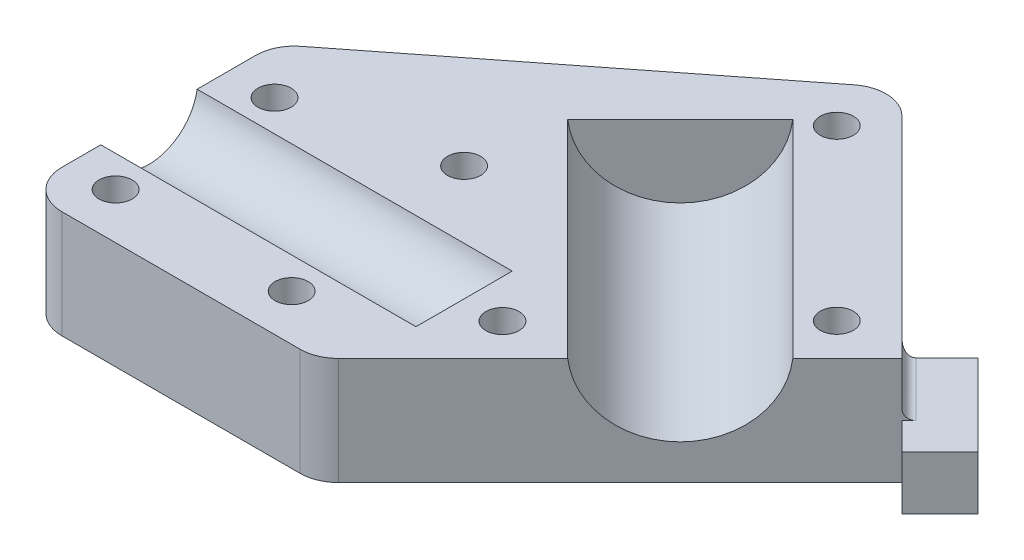
ISO-10303-21;
HEADER;
FILE_DESCRIPTION(('STEP AP214'),'2;1');
FILE_NAME('part.step','',(''),(''),'','','');
FILE_SCHEMA(('AUTOMOTIVE_DESIGN { 1 0 10303 214 1 1 1 1 }'));
ENDSEC;
DATA;
#1=APPLICATION_CONTEXT('core data for automotive mechanical design processes');
#2=APPLICATION_PROTOCOL_DEFINITION('international standard','automotive_design',2000,#1);
#3=PRODUCT_CONTEXT('',#1,'mechanical');
#4=PRODUCT('Part','Part','',(#3));
#5=PRODUCT_RELATED_PRODUCT_CATEGORY('part','',(#4));
#6=PRODUCT_DEFINITION_FORMATION('','',#4);
#7=PRODUCT_DEFINITION_CONTEXT('part definition',#1,'design');
#8=PRODUCT_DEFINITION('design','',#6,#7);
#9=PRODUCT_DEFINITION_SHAPE('','',#8);
#10=(LENGTH_UNIT() NAMED_UNIT(*) SI_UNIT(.MILLI.,.METRE.));
#11=(NAMED_UNIT(*) PLANE_ANGLE_UNIT() SI_UNIT($,.RADIAN.));
#12=(NAMED_UNIT(*) SI_UNIT($,.STERADIAN.) SOLID_ANGLE_UNIT());
#13=UNCERTAINTY_MEASURE_WITH_UNIT(LENGTH_MEASURE(1.E-05),#10,'distance_accuracy_value','');
#14=(GEOMETRIC_REPRESENTATION_CONTEXT(3) GLOBAL_UNCERTAINTY_ASSIGNED_CONTEXT((#13)) GLOBAL_UNIT_ASSIGNED_CONTEXT((#10,
#11,#12)) REPRESENTATION_CONTEXT('',''));
#15=CARTESIAN_POINT('',(0.,0.,0.));
#16=DIRECTION('',(0.,0.,1.));
#17=DIRECTION('',(1.,0.,0.));
#18=AXIS2_PLACEMENT_3D('',#15,#16,#17);
#19=CARTESIAN_POINT('',(-41.0289321881345,-1.,-16.3499999999999));
#20=DIRECTION('',(-0.617406762156341,0.,-0.78664406820596));
#21=DIRECTION('',(-0.78664406820596,0.,0.617406762156341));
#22=AXIS2_PLACEMENT_3D('',#19,#20,#21);
#23=PLANE('',#22);
#24=DIRECTION('',(0.78664406820596,0.,-0.617406762156341));
#25=VECTOR('',#24,1.);
#26=CARTESIAN_POINT('',(-41.0289321881345,-15.,-16.3499999999999));
#27=LINE('',#26,#25);
#28=CARTESIAN_POINT('',(-39.1159659989162,-15.,-17.8514138016617));
#29=VERTEX_POINT('',#28);
#30=CARTESIAN_POINT('',(1.25585463277242,-15.,-49.5377075983135));
#31=VERTEX_POINT('',#30);
#32=EDGE_CURVE('E239',#29,#31,#27,.T.);
#33=ORIENTED_EDGE('',*,*,#32,.F.);
#34=DIRECTION('',(0.,-1.,0.));
#35=VECTOR('',#34,1.);
#36=CARTESIAN_POINT('',(-39.1159659989162,-1.,-17.8514138016617));
#37=LINE('',#36,#35);
#38=CARTESIAN_POINT('',(-39.1159659989162,-1.,-17.8514138016617));
#39=VERTEX_POINT('',#38);
#40=EDGE_CURVE('E301',#29,#39,#37,.F.);
#41=ORIENTED_EDGE('',*,*,#40,.T.);
#42=DIRECTION('',(0.78664406820596,0.,-0.617406762156341));
#43=VECTOR('',#42,1.);
#44=CARTESIAN_POINT('',(-41.0289321881345,-1.,-16.3499999999999));
#45=LINE('',#44,#43);
#46=CARTESIAN_POINT('',(1.25585463277242,-1.,-49.5377075983135));
#47=VERTEX_POINT('',#46);
#48=EDGE_CURVE('E240',#39,#47,#45,.T.);
#49=ORIENTED_EDGE('',*,*,#48,.T.);
#50=DIRECTION('',(0.,-1.,0.));
#51=VECTOR('',#50,1.);
#52=CARTESIAN_POINT('',(1.25585463277243,-1.,-49.5377075983135));
#53=LINE('',#52,#51);
#54=EDGE_CURVE('E298',#47,#31,#53,.T.);
#55=ORIENTED_EDGE('',*,*,#54,.T.);
#56=EDGE_LOOP('',(#33,#41,#49,#55));
#57=FACE_BOUND('',#56,.T.);
#58=ADVANCED_FACE('F36',(#57),#23,.T.);
#59=CARTESIAN_POINT('',(-41.0289321881345,-1.,16.35));
#60=DIRECTION('',(-1.,0.,0.));
#61=DIRECTION('',(0.,0.,1.));
#62=AXIS2_PLACEMENT_3D('',#59,#60,#61);
#63=PLANE('',#62);
#64=DIRECTION('',(0.,0.,-1.));
#65=VECTOR('',#64,1.);
#66=CARTESIAN_POINT('',(-41.0289321881345,-15.,16.35));
#67=LINE('',#66,#65);
#68=CARTESIAN_POINT('',(-41.0289321881345,-15.,11.35));
#69=VERTEX_POINT('',#68);
#70=CARTESIAN_POINT('',(-41.0289321881345,-15.,-13.9181934606319));
#71=VERTEX_POINT('',#70);
#72=EDGE_CURVE('E244',#69,#71,#67,.T.);
#73=ORIENTED_EDGE('',*,*,#72,.F.);
#74=DIRECTION('',(0.,-1.,0.));
#75=VECTOR('',#74,1.);
#76=CARTESIAN_POINT('',(-41.0289321881345,-1.,11.35));
#77=LINE('',#76,#75);
#78=CARTESIAN_POINT('',(-41.0289321881345,-1.,11.35));
#79=VERTEX_POINT('',#78);
#80=EDGE_CURVE('E285',#69,#79,#77,.F.);
#81=ORIENTED_EDGE('',*,*,#80,.T.);
#82=DIRECTION('',(0.,0.,-1.));
#83=VECTOR('',#82,1.);
#84=CARTESIAN_POINT('',(-41.0289321881345,-1.,16.35));
#85=LINE('',#84,#83);
#86=CARTESIAN_POINT('',(-41.0289321881345,-0.999999999999999,6.27076550350907));
#87=VERTEX_POINT('',#86);
#88=EDGE_CURVE('E253',#79,#87,#85,.T.);
#89=ORIENTED_EDGE('',*,*,#88,.T.);
#90=CARTESIAN_POINT('',(-41.0289321881345,0.,0.));
#91=DIRECTION('',(-1.,0.,0.));
#92=DIRECTION('',(0.,0.,1.));
#93=AXIS2_PLACEMENT_3D('',#90,#91,#92);
#94=CIRCLE('',#93,6.34999999999996);
#95=CARTESIAN_POINT('',(-41.0289321881345,-1.,-6.27076550350908));
#96=VERTEX_POINT('',#95);
#97=EDGE_CURVE('E190',#96,#87,#94,.T.);
#98=ORIENTED_EDGE('',*,*,#97,.F.);
#99=CARTESIAN_POINT('',(-41.0289321881345,-1.,-13.9181934606319));
#100=VERTEX_POINT('',#99);
#101=EDGE_CURVE('E252',#96,#100,#85,.T.);
#102=ORIENTED_EDGE('',*,*,#101,.T.);
#103=DIRECTION('',(0.,-1.,0.));
#104=VECTOR('',#103,1.);
#105=CARTESIAN_POINT('',(-41.0289321881345,-1.,-13.9181934606319));
#106=LINE('',#105,#104);
#107=EDGE_CURVE('E282',#100,#71,#106,.T.);
#108=ORIENTED_EDGE('',*,*,#107,.T.);
#109=EDGE_LOOP('',(#73,#81,#89,#98,#102,#108));
#110=FACE_BOUND('',#109,.T.);
#111=ADVANCED_FACE('F353',(#110),#63,.T.);
#112=CARTESIAN_POINT('',(-2.92893218813456,-1.,16.35));
#113=DIRECTION('',(0.,0.,1.));
#114=DIRECTION('',(1.,0.,0.));
#115=AXIS2_PLACEMENT_3D('',#112,#113,#114);
#116=PLANE('',#115);
#117=DIRECTION('',(-1.,0.,0.));
#118=VECTOR('',#117,1.);
#119=CARTESIAN_POINT('',(-2.92893218813456,-1.,16.35));
#120=LINE('',#119,#118);
#121=CARTESIAN_POINT('',(-5.00000000000003,-1.,16.35));
#122=VERTEX_POINT('',#121);
#123=CARTESIAN_POINT('',(-36.0289321881345,-1.,16.35));
#124=VERTEX_POINT('',#123);
#125=EDGE_CURVE('E249',#122,#124,#120,.T.);
#126=ORIENTED_EDGE('',*,*,#125,.T.);
#127=DIRECTION('',(0.,-1.,0.));
#128=VECTOR('',#127,1.);
#129=CARTESIAN_POINT('',(-36.0289321881345,-1.,16.35));
#130=LINE('',#129,#128);
#131=CARTESIAN_POINT('',(-36.0289321881345,-15.,16.35));
#132=VERTEX_POINT('',#131);
#133=EDGE_CURVE('E271',#124,#132,#130,.T.);
#134=ORIENTED_EDGE('',*,*,#133,.T.);
#135=DIRECTION('',(-1.,0.,0.));
#136=VECTOR('',#135,1.);
#137=CARTESIAN_POINT('',(-2.92893218813456,-15.,16.35));
#138=LINE('',#137,#136);
#139=CARTESIAN_POINT('',(-5.00000000000003,-15.,16.35));
#140=VERTEX_POINT('',#139);
#141=EDGE_CURVE('E263',#140,#132,#138,.T.);
#142=ORIENTED_EDGE('',*,*,#141,.F.);
#143=DIRECTION('',(0.,-1.,0.));
#144=VECTOR('',#143,1.);
#145=CARTESIAN_POINT('',(-5.00000000000003,-1.,16.35));
#146=LINE('',#145,#144);
#147=EDGE_CURVE('E269',#140,#122,#146,.F.);
#148=ORIENTED_EDGE('',*,*,#147,.T.);
#149=EDGE_LOOP('',(#126,#134,#142,#148));
#150=FACE_BOUND('',#149,.T.);
#151=ADVANCED_FACE('F362',(#150),#116,.T.);
#152=CARTESIAN_POINT('',(35.2197556622844,-1.,-21.7986878504189));
#153=DIRECTION('',(0.707106781186547,0.,0.707106781186548));
#154=DIRECTION('',(0.707106781186548,0.,-0.707106781186547));
#155=AXIS2_PLACEMENT_3D('',#152,#153,#154);
#156=PLANE('',#155);
#157=DIRECTION('',(-0.707106781186548,0.,0.707106781186547));
#158=VECTOR('',#157,1.);
#159=CARTESIAN_POINT('',(35.2197556622844,-1.,-21.7986878504189));
#160=LINE('',#159,#158);
#161=CARTESIAN_POINT('',(13.4550962518592,-1.,-0.0340284399936866));
#162=VERTEX_POINT('',#161);
#163=CARTESIAN_POINT('',(-1.46446609406729,-1.,14.8855339059327));
#164=VERTEX_POINT('',#163);
#165=EDGE_CURVE('E189',#162,#164,#160,.T.);
#166=ORIENTED_EDGE('',*,*,#165,.T.);
#167=DIRECTION('',(0.,-1.,0.));
#168=VECTOR('',#167,1.);
#169=CARTESIAN_POINT('',(-1.46446609406729,-1.,14.8855339059327));
#170=LINE('',#169,#168);
#171=CARTESIAN_POINT('',(-1.46446609406729,-15.,14.8855339059327));
#172=VERTEX_POINT('',#171);
#173=EDGE_CURVE('E295',#164,#172,#170,.T.);
#174=ORIENTED_EDGE('',*,*,#173,.T.);
#175=DIRECTION('',(-0.707106781186548,0.,0.707106781186547));
#176=VECTOR('',#175,1.);
#177=CARTESIAN_POINT('',(35.2197556622844,-15.,-21.7986878504189));
#178=LINE('',#177,#176);
#179=CARTESIAN_POINT('',(35.2197556622844,-15.,-21.7986878504189));
#180=VERTEX_POINT('',#179);
#181=EDGE_CURVE('E260',#180,#172,#178,.T.);
#182=ORIENTED_EDGE('',*,*,#181,.F.);
#183=DIRECTION('',(0.,-1.,0.));
#184=VECTOR('',#183,1.);
#185=CARTESIAN_POINT('',(35.2197556622844,-1.,-21.7986878504189));
#186=LINE('',#185,#184);
#187=CARTESIAN_POINT('',(35.2197556622844,-8.,-21.7986878504189));
#188=VERTEX_POINT('',#187);
#189=EDGE_CURVE('E232',#188,#180,#186,.T.);
#190=ORIENTED_EDGE('',*,*,#189,.F.);
#191=DIRECTION('',(-0.707106781186548,0.,0.707106781186547));
#192=VECTOR('',#191,1.);
#193=CARTESIAN_POINT('',(6.71053390593273,-8.,6.71053390593273));
#194=LINE('',#193,#192);
#195=CARTESIAN_POINT('',(36.1177812743913,-8.,-22.6967134625258));
#196=VERTEX_POINT('',#195);
#197=EDGE_CURVE('E306',#196,#188,#194,.T.);
#198=ORIENTED_EDGE('',*,*,#197,.F.);
#199=CARTESIAN_POINT('',(36.1177812743913,-6.73,-22.6967134625258));
#200=DIRECTION('',(0.707106781186547,0.,0.707106781186548));
#201=DIRECTION('',(0.707106781186548,0.,-0.707106781186547));
#202=AXIS2_PLACEMENT_3D('',#199,#200,#201);
#203=CIRCLE('',#202,1.27);
#204=CARTESIAN_POINT('',(35.2197556622844,-6.73,-21.7986878504189));
#205=VERTEX_POINT('',#204);
#206=EDGE_CURVE('E311',#196,#205,#203,.F.);
#207=ORIENTED_EDGE('',*,*,#206,.T.);
#208=DIRECTION('',(0.,-1.,0.));
#209=VECTOR('',#208,1.);
#210=CARTESIAN_POINT('',(35.2197556622844,-1.,-21.7986878504189));
#211=LINE('',#210,#209);
#212=CARTESIAN_POINT('',(35.2197556622844,-1.,-21.7986878504189));
#213=VERTEX_POINT('',#212);
#214=EDGE_CURVE('E255',#213,#205,#211,.T.);
#215=ORIENTED_EDGE('',*,*,#214,.F.);
#216=CARTESIAN_POINT('',(28.1146594104261,-1.00000000000003,-14.6935915985606));
#217=VERTEX_POINT('',#216);
#218=EDGE_CURVE('E246',#213,#217,#160,.T.);
#219=ORIENTED_EDGE('',*,*,#218,.T.);
#220=CARTESIAN_POINT('',(20.7848778311425,0.,-7.36381001927702));
#221=DIRECTION('',(0.707106781186547,0.,0.707106781186548));
#222=DIRECTION('',(0.707106781186548,0.,-0.707106781186547));
#223=AXIS2_PLACEMENT_3D('',#220,#221,#222);
#224=CIRCLE('',#223,10.4140000000003);
#225=EDGE_CURVE('E180',#162,#217,#224,.T.);
#226=ORIENTED_EDGE('',*,*,#225,.F.);
#227=EDGE_LOOP('',(#166,#174,#182,#190,#198,#207,#215,#219,#226));
#228=FACE_BOUND('',#227,.T.);
#229=ADVANCED_FACE('F371',(#228),#156,.T.);
#230=CARTESIAN_POINT('',(4.74345339314427,-1.,-52.2749901195591));
#231=DIRECTION('',(0.707106781186548,0.,-0.707106781186547));
#232=DIRECTION('',(-0.707106781186547,0.,-0.707106781186548));
#233=AXIS2_PLACEMENT_3D('',#230,#231,#232);
#234=PLANE('',#233);
#235=DIRECTION('',(-0.707106781186547,0.,-0.707106781186548));
#236=VECTOR('',#235,1.);
#237=CARTESIAN_POINT('',(4.74345339314427,-6.73,-52.2749901195591));
#238=LINE('',#237,#236);
#239=CARTESIAN_POINT('',(27.250662238312,-6.73,-29.7677812743913));
#240=VERTEX_POINT('',#239);
#241=EDGE_CURVE('E58',#205,#240,#238,.T.);
#242=ORIENTED_EDGE('',*,*,#241,.T.);
#243=DIRECTION('',(0.,-1.,0.));
#244=VECTOR('',#243,1.);
#245=CARTESIAN_POINT('',(27.250662238312,-15.,-29.7677812743913));
#246=LINE('',#245,#244);
#247=CARTESIAN_POINT('',(27.250662238312,-15.,-29.7677812743913));
#248=VERTEX_POINT('',#247);
#249=EDGE_CURVE('E313',#240,#248,#246,.T.);
#250=ORIENTED_EDGE('',*,*,#249,.T.);
#251=DIRECTION('',(0.707106781186547,0.,0.707106781186548));
#252=VECTOR('',#251,1.);
#253=CARTESIAN_POINT('',(4.74345339314427,-15.,-52.2749901195591));
#254=LINE('',#253,#252);
#255=CARTESIAN_POINT('',(7.87842234948687,-15.,-49.1400211632165));
#256=VERTEX_POINT('',#255);
#257=EDGE_CURVE('E258',#256,#248,#254,.T.);
#258=ORIENTED_EDGE('',*,*,#257,.F.);
#259=DIRECTION('',(0.,-1.,0.));
#260=VECTOR('',#259,1.);
#261=CARTESIAN_POINT('',(7.87842234948687,-1.,-49.1400211632165));
#262=LINE('',#261,#260);
#263=CARTESIAN_POINT('',(7.87842234948687,-1.,-49.1400211632165));
#264=VERTEX_POINT('',#263);
#265=EDGE_CURVE('E303',#256,#264,#262,.F.);
#266=ORIENTED_EDGE('',*,*,#265,.T.);
#267=DIRECTION('',(0.707106781186547,0.,0.707106781186548));
#268=VECTOR('',#267,1.);
#269=CARTESIAN_POINT('',(4.74345339314427,-1.,-52.2749901195591));
#270=LINE('',#269,#268);
#271=EDGE_CURVE('E243',#264,#213,#270,.T.);
#272=ORIENTED_EDGE('',*,*,#271,.T.);
#273=ORIENTED_EDGE('',*,*,#214,.T.);
#274=EDGE_LOOP('',(#242,#250,#258,#266,#272,#273));
#275=FACE_BOUND('',#274,.T.);
#276=ADVANCED_FACE('F333',(#275),#234,.T.);
#277=CARTESIAN_POINT('',(0.,-1.,0.));
#278=DIRECTION('',(0.,-1.,0.));
#279=DIRECTION('',(0.,0.,-1.));
#280=AXIS2_PLACEMENT_3D('',#277,#278,#279);
#281=PLANE('',#280);
#282=CARTESIAN_POINT('',(-35.0289321881345,-1.,10.35));
#283=DIRECTION('',(0.,-1.,0.));
#284=DIRECTION('',(0.,0.,-1.));
#285=AXIS2_PLACEMENT_3D('',#282,#283,#284);
#286=CIRCLE('',#285,2.15899999999999);
#287=CARTESIAN_POINT('',(-35.0289321881345,-1.,8.19100000000001));
#288=VERTEX_POINT('',#287);
#289=EDGE_CURVE('E681',#288,#288,#286,.T.);
#290=ORIENTED_EDGE('',*,*,#289,.T.);
#291=EDGE_LOOP('',(#290));
#292=FACE_BOUND('',#291,.T.);
#293=CARTESIAN_POINT('',(5.,-1.,0.));
#294=DIRECTION('',(0.,-1.,0.));
#295=DIRECTION('',(0.,0.,-1.));
#296=AXIS2_PLACEMENT_3D('',#293,#294,#295);
#297=CIRCLE('',#296,2.15899999999999);
#298=CARTESIAN_POINT('',(5.,-1.,-2.15899999999999));
#299=VERTEX_POINT('',#298);
#300=EDGE_CURVE('E675',#299,#299,#297,.T.);
#301=ORIENTED_EDGE('',*,*,#300,.T.);
#302=EDGE_LOOP('',(#301));
#303=FACE_BOUND('',#302,.T.);
#304=CARTESIAN_POINT('',(-15.,-1.,-15.));
#305=DIRECTION('',(0.,-1.,0.));
#306=DIRECTION('',(0.,0.,-1.));
#307=AXIS2_PLACEMENT_3D('',#304,#305,#306);
#308=CIRCLE('',#307,2.15899999999999);
#309=CARTESIAN_POINT('',(-15.,-1.,-17.159));
#310=VERTEX_POINT('',#309);
#311=EDGE_CURVE('E669',#310,#310,#308,.T.);
#312=ORIENTED_EDGE('',*,*,#311,.T.);
#313=EDGE_LOOP('',(#312));
#314=FACE_BOUND('',#313,.T.);
#315=CARTESIAN_POINT('',(-12.1030431086579,-1.,10.35));
#316=DIRECTION('',(0.,-1.,0.));
#317=DIRECTION('',(0.,0.,-1.));
#318=AXIS2_PLACEMENT_3D('',#315,#316,#317);
#319=CIRCLE('',#318,2.15899999999999);
#320=CARTESIAN_POINT('',(-12.1030431086579,-1.,8.19100000000001));
#321=VERTEX_POINT('',#320);
#322=EDGE_CURVE('E663',#321,#321,#319,.T.);
#323=ORIENTED_EDGE('',*,*,#322,.T.);
#324=EDGE_LOOP('',(#323));
#325=FACE_BOUND('',#324,.T.);
#326=CARTESIAN_POINT('',(-35.0289321881345,-1.,-10.35));
#327=DIRECTION('',(0.,-1.,0.));
#328=DIRECTION('',(0.,0.,-1.));
#329=AXIS2_PLACEMENT_3D('',#326,#327,#328);
#330=CIRCLE('',#329,2.15899999999999);
#331=CARTESIAN_POINT('',(-35.0289321881345,-1.,-12.509));
#332=VERTEX_POINT('',#331);
#333=EDGE_CURVE('E657',#332,#332,#330,.T.);
#334=ORIENTED_EDGE('',*,*,#333,.T.);
#335=EDGE_LOOP('',(#334));
#336=FACE_BOUND('',#335,.T.);
#337=CARTESIAN_POINT('',(4.74345339314418,-1.,-43.7897087453206));
#338=DIRECTION('',(0.,-1.,0.));
#339=DIRECTION('',(0.,0.,-1.));
#340=AXIS2_PLACEMENT_3D('',#337,#338,#339);
#341=CIRCLE('',#340,2.15899999999999);
#342=CARTESIAN_POINT('',(4.74345339314418,-1.,-45.9487087453206));
#343=VERTEX_POINT('',#342);
#344=EDGE_CURVE('E648',#343,#343,#341,.T.);
#345=ORIENTED_EDGE('',*,*,#344,.T.);
#346=EDGE_LOOP('',(#345));
#347=FACE_BOUND('',#346,.T.);
#348=CARTESIAN_POINT('',(26.7344742880458,-1.,-21.7986878504189));
#349=DIRECTION('',(0.,-1.,0.));
#350=DIRECTION('',(0.,0.,-1.));
#351=AXIS2_PLACEMENT_3D('',#348,#349,#350);
#352=CIRCLE('',#351,2.15899999999998);
#353=CARTESIAN_POINT('',(26.7344742880458,-1.,-23.9576878504189));
#354=VERTEX_POINT('',#353);
#355=EDGE_CURVE('E643',#354,#354,#352,.T.);
#356=ORIENTED_EDGE('',*,*,#355,.T.);
#357=EDGE_LOOP('',(#356));
#358=FACE_BOUND('',#357,.T.);
#359=ORIENTED_EDGE('',*,*,#88,.F.);
#360=CARTESIAN_POINT('',(-36.0289321881345,-1.,11.35));
#361=DIRECTION('',(0.,-1.,0.));
#362=DIRECTION('',(0.,0.,-1.));
#363=AXIS2_PLACEMENT_3D('',#360,#361,#362);
#364=CIRCLE('',#363,5.);
#365=EDGE_CURVE('E293',#79,#124,#364,.F.);
#366=ORIENTED_EDGE('',*,*,#365,.T.);
#367=ORIENTED_EDGE('',*,*,#125,.F.);
#368=CARTESIAN_POINT('',(-5.00000000000002,-1.,11.35));
#369=DIRECTION('',(0.,-1.,0.));
#370=DIRECTION('',(0.,0.,-1.));
#371=AXIS2_PLACEMENT_3D('',#368,#369,#370);
#372=CIRCLE('',#371,5.);
#373=EDGE_CURVE('E291',#122,#164,#372,.F.);
#374=ORIENTED_EDGE('',*,*,#373,.T.);
#375=ORIENTED_EDGE('',*,*,#165,.F.);
#376=DIRECTION('',(0.707106781186547,0.,0.707106781186548));
#377=VECTOR('',#376,1.);
#378=CARTESIAN_POINT('',(-13.4856721113483,-1.,-26.9747968032011));
#379=LINE('',#378,#377);
#380=CARTESIAN_POINT('',(-13.4856721113483,-1.,-26.9747968032011));
#381=VERTEX_POINT('',#380);
#382=EDGE_CURVE('E173',#381,#162,#379,.T.);
#383=ORIENTED_EDGE('',*,*,#382,.F.);
#384=DIRECTION('',(-0.707106781186548,0.,0.707106781186547));
#385=VECTOR('',#384,1.);
#386=CARTESIAN_POINT('',(1.17389104721863,-1.00000000000003,-41.634359961768));
#387=LINE('',#386,#385);
#388=CARTESIAN_POINT('',(1.17389104721863,-1.,-41.634359961768));
#389=VERTEX_POINT('',#388);
#390=EDGE_CURVE('E179',#389,#381,#387,.T.);
#391=ORIENTED_EDGE('',*,*,#390,.F.);
#392=DIRECTION('',(0.707106781186547,0.,0.707106781186548));
#393=VECTOR('',#392,1.);
#394=CARTESIAN_POINT('',(1.17389104721863,-1.00000000000003,-41.634359961768));
#395=LINE('',#394,#393);
#396=EDGE_CURVE('E176',#389,#217,#395,.T.);
#397=ORIENTED_EDGE('',*,*,#396,.T.);
#398=ORIENTED_EDGE('',*,*,#218,.F.);
#399=ORIENTED_EDGE('',*,*,#271,.F.);
#400=CARTESIAN_POINT('',(4.34288844355413,-1.,-45.6044872572837));
#401=DIRECTION('',(0.,-1.,0.));
#402=DIRECTION('',(0.,0.,-1.));
#403=AXIS2_PLACEMENT_3D('',#400,#401,#402);
#404=CIRCLE('',#403,5.);
#405=EDGE_CURVE('E287',#264,#47,#404,.F.);
#406=ORIENTED_EDGE('',*,*,#405,.T.);
#407=ORIENTED_EDGE('',*,*,#48,.F.);
#408=CARTESIAN_POINT('',(-36.0289321881345,-1.,-13.9181934606319));
#409=DIRECTION('',(0.,-1.,0.));
#410=DIRECTION('',(0.,0.,-1.));
#411=AXIS2_PLACEMENT_3D('',#408,#409,#410);
#412=CIRCLE('',#411,5.);
#413=EDGE_CURVE('E289',#39,#100,#412,.F.);
#414=ORIENTED_EDGE('',*,*,#413,.T.);
#415=ORIENTED_EDGE('',*,*,#101,.F.);
#416=DIRECTION('',(-1.,0.,0.));
#417=VECTOR('',#416,1.);
#418=CARTESIAN_POINT('',(0.,-1.,-6.27076550350908));
#419=LINE('',#418,#417);
#420=CARTESIAN_POINT('',(0.,-1.,-6.27076550350908));
#421=VERTEX_POINT('',#420);
#422=EDGE_CURVE('E203',#421,#96,#419,.T.);
#423=ORIENTED_EDGE('',*,*,#422,.F.);
#424=DIRECTION('',(0.,0.,-1.));
#425=VECTOR('',#424,1.);
#426=CARTESIAN_POINT('',(0.,-0.999999999999999,6.27076550350907));
#427=LINE('',#426,#425);
#428=CARTESIAN_POINT('',(0.,-1.,6.27076550350907));
#429=VERTEX_POINT('',#428);
#430=EDGE_CURVE('E199',#429,#421,#427,.T.);
#431=ORIENTED_EDGE('',*,*,#430,.F.);
#432=DIRECTION('',(-1.,0.,0.));
#433=VECTOR('',#432,1.);
#434=CARTESIAN_POINT('',(0.,-0.999999999999999,6.27076550350907));
#435=LINE('',#434,#433);
#436=EDGE_CURVE('E201',#429,#87,#435,.T.);
#437=ORIENTED_EDGE('',*,*,#436,.T.);
#438=EDGE_LOOP('',(#359,#366,#367,#374,#375,#383,#391,#397,#398,#399,#406,#407,#414,#415,#423,
#431,#437));
#439=FACE_BOUND('',#438,.T.);
#440=ADVANCED_FACE('F187',(#292,#303,#314,#325,#336,#347,#358,#439),#281,.F.);
#441=CARTESIAN_POINT('',(0.,-15.,0.));
#442=DIRECTION('',(0.,-1.,0.));
#443=DIRECTION('',(0.,0.,-1.));
#444=AXIS2_PLACEMENT_3D('',#441,#442,#443);
#445=PLANE('',#444);
#446=CARTESIAN_POINT('',(-35.0289321881345,-15.,10.35));
#447=DIRECTION('',(0.,-1.,0.));
#448=DIRECTION('',(0.,0.,-1.));
#449=AXIS2_PLACEMENT_3D('',#446,#447,#448);
#450=CIRCLE('',#449,2.15899999999999);
#451=CARTESIAN_POINT('',(-35.0289321881345,-15.,8.19100000000001));
#452=VERTEX_POINT('',#451);
#453=EDGE_CURVE('E684',#452,#452,#450,.T.);
#454=ORIENTED_EDGE('',*,*,#453,.F.);
#455=EDGE_LOOP('',(#454));
#456=FACE_BOUND('',#455,.T.);
#457=CARTESIAN_POINT('',(5.,-15.,0.));
#458=DIRECTION('',(0.,-1.,0.));
#459=DIRECTION('',(0.,0.,-1.));
#460=AXIS2_PLACEMENT_3D('',#457,#458,#459);
#461=CIRCLE('',#460,2.15899999999999);
#462=CARTESIAN_POINT('',(5.,-15.,-2.15899999999999));
#463=VERTEX_POINT('',#462);
#464=EDGE_CURVE('E678',#463,#463,#461,.T.);
#465=ORIENTED_EDGE('',*,*,#464,.F.);
#466=EDGE_LOOP('',(#465));
#467=FACE_BOUND('',#466,.T.);
#468=CARTESIAN_POINT('',(-15.,-15.,-15.));
#469=DIRECTION('',(0.,-1.,0.));
#470=DIRECTION('',(0.,0.,-1.));
#471=AXIS2_PLACEMENT_3D('',#468,#469,#470);
#472=CIRCLE('',#471,2.15899999999999);
#473=CARTESIAN_POINT('',(-15.,-15.,-17.159));
#474=VERTEX_POINT('',#473);
#475=EDGE_CURVE('E672',#474,#474,#472,.T.);
#476=ORIENTED_EDGE('',*,*,#475,.F.);
#477=EDGE_LOOP('',(#476));
#478=FACE_BOUND('',#477,.T.);
#479=CARTESIAN_POINT('',(-12.1030431086579,-15.,10.35));
#480=DIRECTION('',(0.,-1.,0.));
#481=DIRECTION('',(0.,0.,-1.));
#482=AXIS2_PLACEMENT_3D('',#479,#480,#481);
#483=CIRCLE('',#482,2.15899999999999);
#484=CARTESIAN_POINT('',(-12.1030431086579,-15.,8.19100000000001));
#485=VERTEX_POINT('',#484);
#486=EDGE_CURVE('E666',#485,#485,#483,.T.);
#487=ORIENTED_EDGE('',*,*,#486,.F.);
#488=EDGE_LOOP('',(#487));
#489=FACE_BOUND('',#488,.T.);
#490=CARTESIAN_POINT('',(-35.0289321881345,-15.,-10.35));
#491=DIRECTION('',(0.,-1.,0.));
#492=DIRECTION('',(0.,0.,-1.));
#493=AXIS2_PLACEMENT_3D('',#490,#491,#492);
#494=CIRCLE('',#493,2.15899999999999);
#495=CARTESIAN_POINT('',(-35.0289321881345,-15.,-12.509));
#496=VERTEX_POINT('',#495);
#497=EDGE_CURVE('E660',#496,#496,#494,.T.);
#498=ORIENTED_EDGE('',*,*,#497,.F.);
#499=EDGE_LOOP('',(#498));
#500=FACE_BOUND('',#499,.T.);
#501=CARTESIAN_POINT('',(4.74345339314418,-15.,-43.7897087453206));
#502=DIRECTION('',(0.,-1.,0.));
#503=DIRECTION('',(0.,0.,-1.));
#504=AXIS2_PLACEMENT_3D('',#501,#502,#503);
#505=CIRCLE('',#504,2.15899999999999);
#506=CARTESIAN_POINT('',(4.74345339314418,-15.,-45.9487087453206));
#507=VERTEX_POINT('',#506);
#508=EDGE_CURVE('E652',#507,#507,#505,.T.);
#509=ORIENTED_EDGE('',*,*,#508,.F.);
#510=EDGE_LOOP('',(#509));
#511=FACE_BOUND('',#510,.T.);
#512=CARTESIAN_POINT('',(26.7344742880458,-15.,-21.7986878504189));
#513=DIRECTION('',(0.,-1.,0.));
#514=DIRECTION('',(0.,0.,-1.));
#515=AXIS2_PLACEMENT_3D('',#512,#513,#514);
#516=CIRCLE('',#515,2.15899999999999);
#517=CARTESIAN_POINT('',(26.7344742880458,-15.,-23.9576878504189));
#518=VERTEX_POINT('',#517);
#519=EDGE_CURVE('E646',#518,#518,#516,.T.);
#520=ORIENTED_EDGE('',*,*,#519,.F.);
#521=EDGE_LOOP('',(#520));
#522=FACE_BOUND('',#521,.T.);
#523=ORIENTED_EDGE('',*,*,#141,.T.);
#524=CARTESIAN_POINT('',(-36.0289321881345,-15.,11.35));
#525=DIRECTION('',(0.,-1.,0.));
#526=DIRECTION('',(0.,0.,-1.));
#527=AXIS2_PLACEMENT_3D('',#524,#525,#526);
#528=CIRCLE('',#527,5.);
#529=EDGE_CURVE('E280',#132,#69,#528,.T.);
#530=ORIENTED_EDGE('',*,*,#529,.T.);
#531=ORIENTED_EDGE('',*,*,#72,.T.);
#532=CARTESIAN_POINT('',(-36.0289321881345,-15.,-13.9181934606319));
#533=DIRECTION('',(0.,-1.,0.));
#534=DIRECTION('',(0.,0.,-1.));
#535=AXIS2_PLACEMENT_3D('',#532,#533,#534);
#536=CIRCLE('',#535,5.);
#537=EDGE_CURVE('E276',#71,#29,#536,.T.);
#538=ORIENTED_EDGE('',*,*,#537,.T.);
#539=ORIENTED_EDGE('',*,*,#32,.T.);
#540=CARTESIAN_POINT('',(4.34288844355413,-15.,-45.6044872572837));
#541=DIRECTION('',(0.,-1.,0.));
#542=DIRECTION('',(0.,0.,-1.));
#543=AXIS2_PLACEMENT_3D('',#540,#541,#542);
#544=CIRCLE('',#543,5.);
#545=EDGE_CURVE('E274',#31,#256,#544,.T.);
#546=ORIENTED_EDGE('',*,*,#545,.T.);
#547=ORIENTED_EDGE('',*,*,#257,.T.);
#548=CARTESIAN_POINT('',(28.148687850419,-15.,-30.6658068864982));
#549=DIRECTION('',(0.,-1.,0.));
#550=DIRECTION('',(0.,0.,-1.));
#551=AXIS2_PLACEMENT_3D('',#548,#549,#550);
#552=CIRCLE('',#551,1.27);
#553=CARTESIAN_POINT('',(29.0467134625259,-15.,-29.7677812743913));
#554=VERTEX_POINT('',#553);
#555=EDGE_CURVE('E44',#248,#554,#552,.F.);
#556=ORIENTED_EDGE('',*,*,#555,.T.);
#557=DIRECTION('',(0.707106781186548,0.,-0.707106781186548));
#558=VECTOR('',#557,1.);
#559=CARTESIAN_POINT('',(28.1486878504189,-15.,-28.8697556622843));
#560=LINE('',#559,#558);
#561=CARTESIAN_POINT('',(33.0984353187248,-15.,-33.8195031305902));
#562=VERTEX_POINT('',#561);
#563=EDGE_CURVE('E212',#554,#562,#560,.T.);
#564=ORIENTED_EDGE('',*,*,#563,.T.);
#565=DIRECTION('',(0.707106781186547,0.,0.707106781186548));
#566=VECTOR('',#565,1.);
#567=CARTESIAN_POINT('',(33.0984353187248,-15.,-33.8195031305902));
#568=LINE('',#567,#566);
#569=CARTESIAN_POINT('',(43.7050370365229,-15.,-23.2129014127921));
#570=VERTEX_POINT('',#569);
#571=EDGE_CURVE('E205',#562,#570,#568,.T.);
#572=ORIENTED_EDGE('',*,*,#571,.T.);
#573=DIRECTION('',(-0.707106781186547,0.,0.707106781186548));
#574=VECTOR('',#573,1.);
#575=CARTESIAN_POINT('',(43.7050370365229,-15.,-23.2129014127921));
#576=LINE('',#575,#574);
#577=CARTESIAN_POINT('',(38.755289568217,-15.,-18.2631539444862));
#578=VERTEX_POINT('',#577);
#579=EDGE_CURVE('E223',#570,#578,#576,.T.);
#580=ORIENTED_EDGE('',*,*,#579,.T.);
#581=DIRECTION('',(-0.707106781186548,0.,-0.707106781186547));
#582=VECTOR('',#581,1.);
#583=CARTESIAN_POINT('',(35.2197556622844,-15.,-21.7986878504189));
#584=LINE('',#583,#582);
#585=EDGE_CURVE('E226',#578,#180,#584,.T.);
#586=ORIENTED_EDGE('',*,*,#585,.T.);
#587=ORIENTED_EDGE('',*,*,#181,.T.);
#588=CARTESIAN_POINT('',(-5.00000000000002,-15.,11.35));
#589=DIRECTION('',(0.,-1.,0.));
#590=DIRECTION('',(0.,0.,-1.));
#591=AXIS2_PLACEMENT_3D('',#588,#589,#590);
#592=CIRCLE('',#591,5.);
#593=EDGE_CURVE('E278',#172,#140,#592,.T.);
#594=ORIENTED_EDGE('',*,*,#593,.T.);
#595=EDGE_LOOP('',(#523,#530,#531,#538,#539,#546,#547,#556,#564,#572,#580,#586,#587,#594));
#596=FACE_BOUND('',#595,.T.);
#597=ADVANCED_FACE('F335',(#456,#467,#478,#489,#500,#511,#522,#596),#445,.T.);
#598=CARTESIAN_POINT('',(33.0984353187248,-8.,-33.8195031305902));
#599=DIRECTION('',(0.707106781186548,0.,-0.707106781186547));
#600=DIRECTION('',(-0.707106781186547,0.,-0.707106781186548));
#601=AXIS2_PLACEMENT_3D('',#598,#599,#600);
#602=PLANE('',#601);
#603=ORIENTED_EDGE('',*,*,#571,.F.);
#604=DIRECTION('',(0.,-1.,0.));
#605=VECTOR('',#604,1.);
#606=CARTESIAN_POINT('',(33.0984353187248,-8.,-33.8195031305902));
#607=LINE('',#606,#605);
#608=CARTESIAN_POINT('',(33.0984353187248,-8.,-33.8195031305902));
#609=VERTEX_POINT('',#608);
#610=EDGE_CURVE('E229',#609,#562,#607,.T.);
#611=ORIENTED_EDGE('',*,*,#610,.F.);
#612=DIRECTION('',(0.707106781186547,0.,0.707106781186548));
#613=VECTOR('',#612,1.);
#614=CARTESIAN_POINT('',(33.0984353187248,-8.,-33.8195031305902));
#615=LINE('',#614,#613);
#616=CARTESIAN_POINT('',(43.7050370365229,-8.,-23.2129014127921));
#617=VERTEX_POINT('',#616);
#618=EDGE_CURVE('E208',#609,#617,#615,.T.);
#619=ORIENTED_EDGE('',*,*,#618,.T.);
#620=DIRECTION('',(0.,-1.,0.));
#621=VECTOR('',#620,1.);
#622=CARTESIAN_POINT('',(43.7050370365229,-8.,-23.2129014127921));
#623=LINE('',#622,#621);
#624=EDGE_CURVE('E220',#617,#570,#623,.T.);
#625=ORIENTED_EDGE('',*,*,#624,.T.);
#626=EDGE_LOOP('',(#603,#611,#619,#625));
#627=FACE_BOUND('',#626,.T.);
#628=ADVANCED_FACE('F382',(#627),#602,.T.);
#629=CARTESIAN_POINT('',(28.1486878504189,-8.,-28.8697556622843));
#630=DIRECTION('',(-0.707106781186548,0.,-0.707106781186548));
#631=DIRECTION('',(-0.707106781186548,0.,0.707106781186548));
#632=AXIS2_PLACEMENT_3D('',#629,#630,#631);
#633=PLANE('',#632);
#634=ORIENTED_EDGE('',*,*,#563,.F.);
#635=DIRECTION('',(0.,-1.,0.));
#636=VECTOR('',#635,1.);
#637=CARTESIAN_POINT('',(29.0467134625259,-6.73,-29.7677812743913));
#638=LINE('',#637,#636);
#639=CARTESIAN_POINT('',(29.0467134625259,-8.,-29.7677812743913));
#640=VERTEX_POINT('',#639);
#641=EDGE_CURVE('E315',#554,#640,#638,.F.);
#642=ORIENTED_EDGE('',*,*,#641,.T.);
#643=DIRECTION('',(0.707106781186548,0.,-0.707106781186548));
#644=VECTOR('',#643,1.);
#645=CARTESIAN_POINT('',(28.1486878504189,-8.,-28.8697556622843));
#646=LINE('',#645,#644);
#647=EDGE_CURVE('E218',#640,#609,#646,.T.);
#648=ORIENTED_EDGE('',*,*,#647,.T.);
#649=ORIENTED_EDGE('',*,*,#610,.T.);
#650=EDGE_LOOP('',(#634,#642,#648,#649));
#651=FACE_BOUND('',#650,.T.);
#652=ADVANCED_FACE('F319',(#651),#633,.T.);
#653=CARTESIAN_POINT('',(35.2197556622844,-8.,-21.7986878504189));
#654=DIRECTION('',(-0.707106781186547,0.,0.707106781186548));
#655=DIRECTION('',(0.707106781186548,0.,0.707106781186547));
#656=AXIS2_PLACEMENT_3D('',#653,#654,#655);
#657=PLANE('',#656);
#658=DIRECTION('',(-0.707106781186537,0.,-0.707106781186558));
#659=VECTOR('',#658,1.);
#660=CARTESIAN_POINT('',(38.755289568217,-8.,-18.2631539444862));
#661=LINE('',#660,#659);
#662=CARTESIAN_POINT('',(38.755289568217,-8.,-18.2631539444862));
#663=VERTEX_POINT('',#662);
#664=EDGE_CURVE('E215',#663,#188,#661,.T.);
#665=ORIENTED_EDGE('',*,*,#664,.T.);
#666=ORIENTED_EDGE('',*,*,#189,.T.);
#667=ORIENTED_EDGE('',*,*,#585,.F.);
#668=DIRECTION('',(0.,-1.,0.));
#669=VECTOR('',#668,1.);
#670=CARTESIAN_POINT('',(38.755289568217,-8.,-18.2631539444862));
#671=LINE('',#670,#669);
#672=EDGE_CURVE('E233',#663,#578,#671,.T.);
#673=ORIENTED_EDGE('',*,*,#672,.F.);
#674=EDGE_LOOP('',(#665,#666,#667,#673));
#675=FACE_BOUND('',#674,.T.);
#676=ADVANCED_FACE('F375',(#675),#657,.T.);
#677=CARTESIAN_POINT('',(43.7050370365229,-8.,-23.2129014127921));
#678=DIRECTION('',(0.707106781186548,0.,0.707106781186547));
#679=DIRECTION('',(0.707106781186547,0.,-0.707106781186548));
#680=AXIS2_PLACEMENT_3D('',#677,#678,#679);
#681=PLANE('',#680);
#682=ORIENTED_EDGE('',*,*,#579,.F.);
#683=ORIENTED_EDGE('',*,*,#624,.F.);
#684=DIRECTION('',(-0.707106781186547,0.,0.707106781186548));
#685=VECTOR('',#684,1.);
#686=CARTESIAN_POINT('',(43.7050370365229,-8.,-23.2129014127921));
#687=LINE('',#686,#685);
#688=EDGE_CURVE('E211',#617,#663,#687,.T.);
#689=ORIENTED_EDGE('',*,*,#688,.T.);
#690=ORIENTED_EDGE('',*,*,#672,.T.);
#691=EDGE_LOOP('',(#682,#683,#689,#690));
#692=FACE_BOUND('',#691,.T.);
#693=ADVANCED_FACE('F379',(#692),#681,.T.);
#694=CARTESIAN_POINT('',(0.,-8.,0.));
#695=DIRECTION('',(0.,-1.,0.));
#696=DIRECTION('',(0.,0.,-1.));
#697=AXIS2_PLACEMENT_3D('',#694,#695,#696);
#698=PLANE('',#697);
#699=ORIENTED_EDGE('',*,*,#647,.F.);
#700=DIRECTION('',(-0.707106781186547,0.,-0.707106781186548));
#701=VECTOR('',#700,1.);
#702=CARTESIAN_POINT('',(29.4072473684586,-8.,-29.4072473684586));
#703=LINE('',#702,#701);
#704=EDGE_CURVE('E308',#640,#196,#703,.F.);
#705=ORIENTED_EDGE('',*,*,#704,.T.);
#706=ORIENTED_EDGE('',*,*,#197,.T.);
#707=ORIENTED_EDGE('',*,*,#664,.F.);
#708=ORIENTED_EDGE('',*,*,#688,.F.);
#709=ORIENTED_EDGE('',*,*,#618,.F.);
#710=EDGE_LOOP('',(#699,#705,#706,#707,#708,#709));
#711=FACE_BOUND('',#710,.T.);
#712=ADVANCED_FACE('F326',(#711),#698,.F.);
#713=CARTESIAN_POINT('',(0.,0.,0.));
#714=DIRECTION('',(-1.,0.,0.));
#715=DIRECTION('',(0.,0.,1.));
#716=AXIS2_PLACEMENT_3D('',#713,#714,#715);
#717=CYLINDRICAL_SURFACE('',#716,6.34999999999996);
#718=ORIENTED_EDGE('',*,*,#97,.T.);
#719=ORIENTED_EDGE('',*,*,#436,.F.);
#720=CARTESIAN_POINT('',(0.,0.,0.));
#721=DIRECTION('',(-1.,0.,0.));
#722=DIRECTION('',(0.,0.,1.));
#723=AXIS2_PLACEMENT_3D('',#720,#721,#722);
#724=CIRCLE('',#723,6.34999999999996);
#725=EDGE_CURVE('E193',#421,#429,#724,.T.);
#726=ORIENTED_EDGE('',*,*,#725,.F.);
#727=ORIENTED_EDGE('',*,*,#422,.T.);
#728=EDGE_LOOP('',(#718,#719,#726,#727));
#729=FACE_BOUND('',#728,.T.);
#730=ADVANCED_FACE('F431',(#729),#717,.F.);
#731=CARTESIAN_POINT('',(0.,0.,0.));
#732=DIRECTION('',(-1.,0.,0.));
#733=DIRECTION('',(0.,0.,1.));
#734=AXIS2_PLACEMENT_3D('',#731,#732,#733);
#735=PLANE('',#734);
#736=ORIENTED_EDGE('',*,*,#725,.T.);
#737=ORIENTED_EDGE('',*,*,#430,.T.);
#738=EDGE_LOOP('',(#736,#737));
#739=FACE_BOUND('',#738,.T.);
#740=ADVANCED_FACE('F600',(#739),#735,.T.);
#741=CARTESIAN_POINT('',(-6.15589053206494,0.,-34.3045783824845));
#742=DIRECTION('',(0.707106781186547,0.,0.707106781186548));
#743=DIRECTION('',(0.707106781186548,0.,-0.707106781186547));
#744=AXIS2_PLACEMENT_3D('',#741,#742,#743);
#745=CYLINDRICAL_SURFACE('',#744,10.4140000000003);
#746=ORIENTED_EDGE('',*,*,#225,.T.);
#747=ORIENTED_EDGE('',*,*,#396,.F.);
#748=CARTESIAN_POINT('',(-6.15589053206494,0.,-34.3045783824845));
#749=DIRECTION('',(0.707106781186547,0.,0.707106781186548));
#750=DIRECTION('',(0.707106781186548,0.,-0.707106781186547));
#751=AXIS2_PLACEMENT_3D('',#748,#749,#750);
#752=CIRCLE('',#751,10.4140000000003);
#753=EDGE_CURVE('E169',#381,#389,#752,.T.);
#754=ORIENTED_EDGE('',*,*,#753,.F.);
#755=ORIENTED_EDGE('',*,*,#382,.T.);
#756=EDGE_LOOP('',(#746,#747,#754,#755));
#757=FACE_BOUND('',#756,.T.);
#758=ADVANCED_FACE('F171',(#757),#745,.F.);
#759=CARTESIAN_POINT('',(-6.15589053206494,0.,-34.3045783824845));
#760=DIRECTION('',(0.707106781186547,0.,0.707106781186548));
#761=DIRECTION('',(0.707106781186548,0.,-0.707106781186547));
#762=AXIS2_PLACEMENT_3D('',#759,#760,#761);
#763=PLANE('',#762);
#764=ORIENTED_EDGE('',*,*,#753,.T.);
#765=ORIENTED_EDGE('',*,*,#390,.T.);
#766=EDGE_LOOP('',(#764,#765));
#767=FACE_BOUND('',#766,.T.);
#768=ADVANCED_FACE('F182',(#767),#763,.T.);
#769=CARTESIAN_POINT('',(26.7344742880458,-15.,-21.7986878504189));
#770=DIRECTION('',(0.,-1.,0.));
#771=DIRECTION('',(0.,0.,-1.));
#772=AXIS2_PLACEMENT_3D('',#769,#770,#771);
#773=CYLINDRICAL_SURFACE('',#772,2.15899999999999);
#774=ORIENTED_EDGE('',*,*,#355,.F.);
#775=EDGE_LOOP('',(#774));
#776=FACE_BOUND('',#775,.T.);
#777=ORIENTED_EDGE('',*,*,#519,.T.);
#778=EDGE_LOOP('',(#777));
#779=FACE_BOUND('',#778,.T.);
#780=ADVANCED_FACE('F573',(#776,#779),#773,.F.);
#781=CARTESIAN_POINT('',(4.74345339314418,-15.,-43.7897087453206));
#782=DIRECTION('',(0.,-1.,0.));
#783=DIRECTION('',(0.,0.,-1.));
#784=AXIS2_PLACEMENT_3D('',#781,#782,#783);
#785=CYLINDRICAL_SURFACE('',#784,2.15899999999999);
#786=ORIENTED_EDGE('',*,*,#344,.F.);
#787=EDGE_LOOP('',(#786));
#788=FACE_BOUND('',#787,.T.);
#789=ORIENTED_EDGE('',*,*,#508,.T.);
#790=EDGE_LOOP('',(#789));
#791=FACE_BOUND('',#790,.T.);
#792=ADVANCED_FACE('F563',(#788,#791),#785,.F.);
#793=CARTESIAN_POINT('',(-35.0289321881345,-15.,-10.35));
#794=DIRECTION('',(0.,-1.,0.));
#795=DIRECTION('',(0.,0.,-1.));
#796=AXIS2_PLACEMENT_3D('',#793,#794,#795);
#797=CYLINDRICAL_SURFACE('',#796,2.15899999999999);
#798=ORIENTED_EDGE('',*,*,#333,.F.);
#799=EDGE_LOOP('',(#798));
#800=FACE_BOUND('',#799,.T.);
#801=ORIENTED_EDGE('',*,*,#497,.T.);
#802=EDGE_LOOP('',(#801));
#803=FACE_BOUND('',#802,.T.);
#804=ADVANCED_FACE('F553',(#800,#803),#797,.F.);
#805=CARTESIAN_POINT('',(-12.1030431086579,-15.,10.35));
#806=DIRECTION('',(0.,-1.,0.));
#807=DIRECTION('',(0.,0.,-1.));
#808=AXIS2_PLACEMENT_3D('',#805,#806,#807);
#809=CYLINDRICAL_SURFACE('',#808,2.15899999999999);
#810=ORIENTED_EDGE('',*,*,#322,.F.);
#811=EDGE_LOOP('',(#810));
#812=FACE_BOUND('',#811,.T.);
#813=ORIENTED_EDGE('',*,*,#486,.T.);
#814=EDGE_LOOP('',(#813));
#815=FACE_BOUND('',#814,.T.);
#816=ADVANCED_FACE('F543',(#812,#815),#809,.F.);
#817=CARTESIAN_POINT('',(-15.,-15.,-15.));
#818=DIRECTION('',(0.,-1.,0.));
#819=DIRECTION('',(0.,0.,-1.));
#820=AXIS2_PLACEMENT_3D('',#817,#818,#819);
#821=CYLINDRICAL_SURFACE('',#820,2.15899999999999);
#822=ORIENTED_EDGE('',*,*,#311,.F.);
#823=EDGE_LOOP('',(#822));
#824=FACE_BOUND('',#823,.T.);
#825=ORIENTED_EDGE('',*,*,#475,.T.);
#826=EDGE_LOOP('',(#825));
#827=FACE_BOUND('',#826,.T.);
#828=ADVANCED_FACE('F533',(#824,#827),#821,.F.);
#829=CARTESIAN_POINT('',(5.,-15.,0.));
#830=DIRECTION('',(0.,-1.,0.));
#831=DIRECTION('',(0.,0.,-1.));
#832=AXIS2_PLACEMENT_3D('',#829,#830,#831);
#833=CYLINDRICAL_SURFACE('',#832,2.15899999999999);
#834=ORIENTED_EDGE('',*,*,#300,.F.);
#835=EDGE_LOOP('',(#834));
#836=FACE_BOUND('',#835,.T.);
#837=ORIENTED_EDGE('',*,*,#464,.T.);
#838=EDGE_LOOP('',(#837));
#839=FACE_BOUND('',#838,.T.);
#840=ADVANCED_FACE('F523',(#836,#839),#833,.F.);
#841=CARTESIAN_POINT('',(-35.0289321881345,-15.,10.35));
#842=DIRECTION('',(0.,-1.,0.));
#843=DIRECTION('',(0.,0.,-1.));
#844=AXIS2_PLACEMENT_3D('',#841,#842,#843);
#845=CYLINDRICAL_SURFACE('',#844,2.15899999999999);
#846=ORIENTED_EDGE('',*,*,#289,.F.);
#847=EDGE_LOOP('',(#846));
#848=FACE_BOUND('',#847,.T.);
#849=ORIENTED_EDGE('',*,*,#453,.T.);
#850=EDGE_LOOP('',(#849));
#851=FACE_BOUND('',#850,.T.);
#852=ADVANCED_FACE('F405',(#848,#851),#845,.F.);
#853=CARTESIAN_POINT('',(-36.0289321881345,-1.,11.35));
#854=DIRECTION('',(0.,-1.,0.));
#855=DIRECTION('',(0.,0.,-1.));
#856=AXIS2_PLACEMENT_3D('',#853,#854,#855);
#857=CYLINDRICAL_SURFACE('',#856,5.);
#858=ORIENTED_EDGE('',*,*,#365,.F.);
#859=ORIENTED_EDGE('',*,*,#80,.F.);
#860=ORIENTED_EDGE('',*,*,#529,.F.);
#861=ORIENTED_EDGE('',*,*,#133,.F.);
#862=EDGE_LOOP('',(#858,#859,#860,#861));
#863=FACE_BOUND('',#862,.T.);
#864=ADVANCED_FACE('F360',(#863),#857,.T.);
#865=CARTESIAN_POINT('',(-5.00000000000002,-1.,11.35));
#866=DIRECTION('',(0.,-1.,0.));
#867=DIRECTION('',(0.,0.,-1.));
#868=AXIS2_PLACEMENT_3D('',#865,#866,#867);
#869=CYLINDRICAL_SURFACE('',#868,5.);
#870=ORIENTED_EDGE('',*,*,#373,.F.);
#871=ORIENTED_EDGE('',*,*,#147,.F.);
#872=ORIENTED_EDGE('',*,*,#593,.F.);
#873=ORIENTED_EDGE('',*,*,#173,.F.);
#874=EDGE_LOOP('',(#870,#871,#872,#873));
#875=FACE_BOUND('',#874,.T.);
#876=ADVANCED_FACE('F368',(#875),#869,.T.);
#877=CARTESIAN_POINT('',(-36.0289321881345,-1.,-13.9181934606319));
#878=DIRECTION('',(0.,-1.,0.));
#879=DIRECTION('',(0.,0.,-1.));
#880=AXIS2_PLACEMENT_3D('',#877,#878,#879);
#881=CYLINDRICAL_SURFACE('',#880,5.);
#882=ORIENTED_EDGE('',*,*,#413,.F.);
#883=ORIENTED_EDGE('',*,*,#40,.F.);
#884=ORIENTED_EDGE('',*,*,#537,.F.);
#885=ORIENTED_EDGE('',*,*,#107,.F.);
#886=EDGE_LOOP('',(#882,#883,#884,#885));
#887=FACE_BOUND('',#886,.T.);
#888=ADVANCED_FACE('F350',(#887),#881,.T.);
#889=CARTESIAN_POINT('',(4.34288844355413,-1.,-45.6044872572837));
#890=DIRECTION('',(0.,-1.,0.));
#891=DIRECTION('',(0.,0.,-1.));
#892=AXIS2_PLACEMENT_3D('',#889,#890,#891);
#893=CYLINDRICAL_SURFACE('',#892,5.);
#894=ORIENTED_EDGE('',*,*,#405,.F.);
#895=ORIENTED_EDGE('',*,*,#265,.F.);
#896=ORIENTED_EDGE('',*,*,#545,.F.);
#897=ORIENTED_EDGE('',*,*,#54,.F.);
#898=EDGE_LOOP('',(#894,#895,#896,#897));
#899=FACE_BOUND('',#898,.T.);
#900=ADVANCED_FACE('F340',(#899),#893,.T.);
#901=CARTESIAN_POINT('',(5.64147900525119,-6.73,-53.173015731666));
#902=DIRECTION('',(-0.707106781186547,0.,-0.707106781186548));
#903=DIRECTION('',(-0.707106781186548,0.,0.707106781186547));
#904=AXIS2_PLACEMENT_3D('',#901,#902,#903);
#905=CYLINDRICAL_SURFACE('',#904,1.27);
#906=ORIENTED_EDGE('',*,*,#206,.F.);
#907=ORIENTED_EDGE('',*,*,#704,.F.);
#908=CARTESIAN_POINT('',(28.148687850419,-6.73,-30.6658068864982));
#909=DIRECTION('',(-0.5,-0.707106781186547,-0.5));
#910=DIRECTION('',(-0.5,0.707106781186547,-0.5));
#911=AXIS2_PLACEMENT_3D('',#908,#909,#910);
#912=ELLIPSE('',#911,1.79605122421383,1.27);
#913=EDGE_CURVE('E11',#640,#240,#912,.T.);
#914=ORIENTED_EDGE('',*,*,#913,.T.);
#915=ORIENTED_EDGE('',*,*,#241,.F.);
#916=EDGE_LOOP('',(#906,#907,#914,#915));
#917=FACE_BOUND('',#916,.T.);
#918=ADVANCED_FACE('F330',(#917),#905,.F.);
#919=CARTESIAN_POINT('',(28.148687850419,-1.,-30.6658068864982));
#920=DIRECTION('',(0.,1.,0.));
#921=DIRECTION('',(0.,0.,1.));
#922=AXIS2_PLACEMENT_3D('',#919,#920,#921);
#923=CYLINDRICAL_SURFACE('',#922,1.27);
#924=ORIENTED_EDGE('',*,*,#913,.F.);
#925=ORIENTED_EDGE('',*,*,#641,.F.);
#926=ORIENTED_EDGE('',*,*,#555,.F.);
#927=ORIENTED_EDGE('',*,*,#249,.F.);
#928=EDGE_LOOP('',(#924,#925,#926,#927));
#929=FACE_BOUND('',#928,.T.);
#930=ADVANCED_FACE('F38',(#929),#923,.F.);
#931=CLOSED_SHELL('',(#58,#111,#151,#229,#276,#440,#597,#628,#652,#676,#693,#712,#730,#740,#758,
#768,#780,#792,#804,#816,#828,#840,#852,#864,#876,#888,#900,#918,#930));
#932=MANIFOLD_SOLID_BREP('B2',#931);
#933=ADVANCED_BREP_SHAPE_REPRESENTATION('',(#18,#932),#14);
#934=SHAPE_DEFINITION_REPRESENTATION(#9,#933);
ENDSEC;
END-ISO-10303-21;
